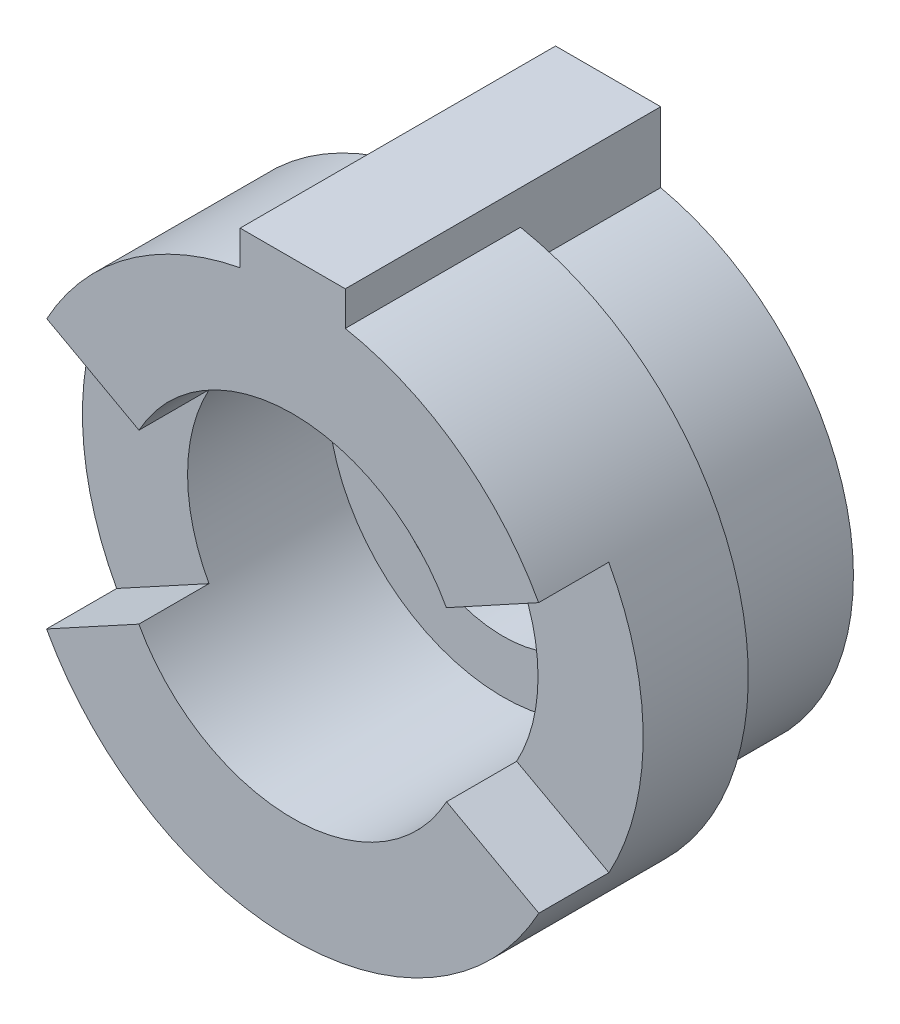
ISO-10303-21;
HEADER;
FILE_DESCRIPTION(('STEP AP214'),'2;1');
FILE_NAME('part.step','',(''),(''),'','','');
FILE_SCHEMA(('AUTOMOTIVE_DESIGN { 1 0 10303 214 1 1 1 1 }'));
ENDSEC;
DATA;
#1=APPLICATION_CONTEXT('core data for automotive mechanical design processes');
#2=APPLICATION_PROTOCOL_DEFINITION('international standard','automotive_design',2000,#1);
#3=PRODUCT_CONTEXT('',#1,'mechanical');
#4=PRODUCT('Part','Part','',(#3));
#5=PRODUCT_RELATED_PRODUCT_CATEGORY('part','',(#4));
#6=PRODUCT_DEFINITION_FORMATION('','',#4);
#7=PRODUCT_DEFINITION_CONTEXT('part definition',#1,'design');
#8=PRODUCT_DEFINITION('design','',#6,#7);
#9=PRODUCT_DEFINITION_SHAPE('','',#8);
#10=(LENGTH_UNIT() NAMED_UNIT(*) SI_UNIT(.MILLI.,.METRE.));
#11=(NAMED_UNIT(*) PLANE_ANGLE_UNIT() SI_UNIT($,.RADIAN.));
#12=(NAMED_UNIT(*) SI_UNIT($,.STERADIAN.) SOLID_ANGLE_UNIT());
#13=UNCERTAINTY_MEASURE_WITH_UNIT(LENGTH_MEASURE(1.E-05),#10,'distance_accuracy_value','');
#14=(GEOMETRIC_REPRESENTATION_CONTEXT(3) GLOBAL_UNCERTAINTY_ASSIGNED_CONTEXT((#13)) GLOBAL_UNIT_ASSIGNED_CONTEXT((#10,
#11,#12)) REPRESENTATION_CONTEXT('',''));
#15=CARTESIAN_POINT('',(0.,0.,0.));
#16=DIRECTION('',(0.,0.,1.));
#17=DIRECTION('',(1.,0.,0.));
#18=AXIS2_PLACEMENT_3D('',#15,#16,#17);
#19=CARTESIAN_POINT('',(0.,0.,9.));
#20=DIRECTION('',(0.,0.,1.));
#21=DIRECTION('',(1.,0.,0.));
#22=AXIS2_PLACEMENT_3D('',#19,#20,#21);
#23=PLANE('',#22);
#24=DIRECTION('',(-0.877200504274681,0.480124229028535,0.));
#25=VECTOR('',#24,1.);
#26=CARTESIAN_POINT('',(-7.01760403419745,3.84099383222828,9.));
#27=LINE('',#26,#25);
#28=CARTESIAN_POINT('',(-4.38600252137341,2.40062114514268,9.));
#29=VERTEX_POINT('',#28);
#30=CARTESIAN_POINT('',(-7.01760403419745,3.84099383222828,9.));
#31=VERTEX_POINT('',#30);
#32=EDGE_CURVE('E239',#29,#31,#27,.T.);
#33=ORIENTED_EDGE('',*,*,#32,.F.);
#34=CARTESIAN_POINT('',(0.,0.,9.));
#35=DIRECTION('',(0.,0.,1.));
#36=DIRECTION('',(1.,0.,0.));
#37=AXIS2_PLACEMENT_3D('',#34,#35,#36);
#38=CIRCLE('',#37,5.);
#39=CARTESIAN_POINT('',(4.38600252137341,2.40062114514267,9.));
#40=VERTEX_POINT('',#39);
#41=EDGE_CURVE('E261',#40,#29,#38,.T.);
#42=ORIENTED_EDGE('',*,*,#41,.F.);
#43=DIRECTION('',(0.877200504274682,0.480124229028534,0.));
#44=VECTOR('',#43,1.);
#45=CARTESIAN_POINT('',(7.01760403419745,3.84099383222827,9.));
#46=LINE('',#45,#44);
#47=CARTESIAN_POINT('',(7.01760403419745,3.84099383222827,9.));
#48=VERTEX_POINT('',#47);
#49=EDGE_CURVE('E93',#40,#48,#46,.T.);
#50=ORIENTED_EDGE('',*,*,#49,.T.);
#51=CARTESIAN_POINT('',(0.,0.,9.));
#52=DIRECTION('',(0.,0.,1.));
#53=DIRECTION('',(1.,0.,0.));
#54=AXIS2_PLACEMENT_3D('',#51,#52,#53);
#55=CIRCLE('',#54,8.);
#56=CARTESIAN_POINT('',(1.50000000000014,7.85811682275083,9.));
#57=VERTEX_POINT('',#56);
#58=EDGE_CURVE('E191',#48,#57,#55,.T.);
#59=ORIENTED_EDGE('',*,*,#58,.T.);
#60=DIRECTION('',(0.,-1.,0.));
#61=VECTOR('',#60,1.);
#62=CARTESIAN_POINT('',(1.50000000000014,7.85811682275083,9.));
#63=LINE('',#62,#61);
#64=CARTESIAN_POINT('',(1.50000000000014,8.83739716558864,9.));
#65=VERTEX_POINT('',#64);
#66=EDGE_CURVE('E172',#65,#57,#63,.T.);
#67=ORIENTED_EDGE('',*,*,#66,.F.);
#68=DIRECTION('',(1.,0.,0.));
#69=VECTOR('',#68,1.);
#70=CARTESIAN_POINT('',(1.50000000000014,8.83739716558864,9.));
#71=LINE('',#70,#69);
#72=CARTESIAN_POINT('',(-1.50000000000014,8.83739716558864,9.));
#73=VERTEX_POINT('',#72);
#74=EDGE_CURVE('E188',#73,#65,#71,.T.);
#75=ORIENTED_EDGE('',*,*,#74,.F.);
#76=DIRECTION('',(0.,1.,0.));
#77=VECTOR('',#76,1.);
#78=CARTESIAN_POINT('',(-1.50000000000014,8.83739716558864,9.));
#79=LINE('',#78,#77);
#80=CARTESIAN_POINT('',(-1.50000000000014,7.85811682275083,9.));
#81=VERTEX_POINT('',#80);
#82=EDGE_CURVE('E181',#81,#73,#79,.T.);
#83=ORIENTED_EDGE('',*,*,#82,.F.);
#84=EDGE_CURVE('E267',#81,#31,#55,.T.);
#85=ORIENTED_EDGE('',*,*,#84,.T.);
#86=EDGE_LOOP('',(#33,#42,#50,#59,#67,#75,#83,#85));
#87=FACE_BOUND('',#86,.T.);
#88=ADVANCED_FACE('F70',(#87),#23,.T.);
#89=CARTESIAN_POINT('',(0.,0.,3.));
#90=DIRECTION('',(0.,0.,1.));
#91=DIRECTION('',(1.,0.,0.));
#92=AXIS2_PLACEMENT_3D('',#89,#90,#91);
#93=PLANE('',#92);
#94=CARTESIAN_POINT('',(0.,0.,3.));
#95=DIRECTION('',(0.,0.,1.));
#96=DIRECTION('',(1.,0.,0.));
#97=AXIS2_PLACEMENT_3D('',#94,#95,#96);
#98=CIRCLE('',#97,5.);
#99=CARTESIAN_POINT('',(5.,0.,3.));
#100=VERTEX_POINT('',#99);
#101=EDGE_CURVE('E271',#100,#100,#98,.F.);
#102=ORIENTED_EDGE('',*,*,#101,.F.);
#103=EDGE_LOOP('',(#102));
#104=FACE_BOUND('',#103,.T.);
#105=CARTESIAN_POINT('',(0.,0.,3.));
#106=DIRECTION('',(0.,0.,1.));
#107=DIRECTION('',(1.,0.,0.));
#108=AXIS2_PLACEMENT_3D('',#105,#106,#107);
#109=CIRCLE('',#108,3.5);
#110=CARTESIAN_POINT('',(3.5,0.,3.));
#111=VERTEX_POINT('',#110);
#112=EDGE_CURVE('E268',#111,#111,#109,.T.);
#113=ORIENTED_EDGE('',*,*,#112,.F.);
#114=EDGE_LOOP('',(#113));
#115=FACE_BOUND('',#114,.T.);
#116=ADVANCED_FACE('F343',(#104,#115),#93,.T.);
#117=CARTESIAN_POINT('',(0.,0.,0.));
#118=DIRECTION('',(0.,0.,1.));
#119=DIRECTION('',(1.,0.,0.));
#120=AXIS2_PLACEMENT_3D('',#117,#118,#119);
#121=PLANE('',#120);
#122=DIRECTION('',(0.,-1.,0.));
#123=VECTOR('',#122,1.);
#124=CARTESIAN_POINT('',(-1.50000000000009,7.85811682275084,0.));
#125=LINE('',#124,#123);
#126=CARTESIAN_POINT('',(-1.50000000000014,8.83739716558864,0.));
#127=VERTEX_POINT('',#126);
#128=CARTESIAN_POINT('',(-1.50000000000009,6.83739716558865,0.));
#129=VERTEX_POINT('',#128);
#130=EDGE_CURVE('E202',#127,#129,#125,.T.);
#131=ORIENTED_EDGE('',*,*,#130,.F.);
#132=DIRECTION('',(1.,0.,0.));
#133=VECTOR('',#132,1.);
#134=CARTESIAN_POINT('',(1.50000000000014,8.83739716558864,0.));
#135=LINE('',#134,#133);
#136=CARTESIAN_POINT('',(1.50000000000014,8.83739716558864,0.));
#137=VERTEX_POINT('',#136);
#138=EDGE_CURVE('E196',#127,#137,#135,.T.);
#139=ORIENTED_EDGE('',*,*,#138,.T.);
#140=DIRECTION('',(0.,1.,0.));
#141=VECTOR('',#140,1.);
#142=CARTESIAN_POINT('',(1.50000000000014,6.83739716558865,0.));
#143=LINE('',#142,#141);
#144=CARTESIAN_POINT('',(1.50000000000014,6.83739716558865,0.));
#145=VERTEX_POINT('',#144);
#146=EDGE_CURVE('E175',#145,#137,#143,.T.);
#147=ORIENTED_EDGE('',*,*,#146,.F.);
#148=CARTESIAN_POINT('',(0.,0.,0.));
#149=DIRECTION('',(0.,0.,1.));
#150=DIRECTION('',(-1.,0.,0.));
#151=AXIS2_PLACEMENT_3D('',#148,#149,#150);
#152=CIRCLE('',#151,7.00000000000001);
#153=EDGE_CURVE('E221',#129,#145,#152,.T.);
#154=ORIENTED_EDGE('',*,*,#153,.F.);
#155=EDGE_LOOP('',(#131,#139,#147,#154));
#156=FACE_BOUND('',#155,.T.);
#157=CARTESIAN_POINT('',(0.,0.,0.));
#158=DIRECTION('',(0.,0.,1.));
#159=DIRECTION('',(1.,0.,0.));
#160=AXIS2_PLACEMENT_3D('',#157,#158,#159);
#161=CIRCLE('',#160,3.5);
#162=CARTESIAN_POINT('',(3.5,0.,0.));
#163=VERTEX_POINT('',#162);
#164=EDGE_CURVE('E266',#163,#163,#161,.T.);
#165=ORIENTED_EDGE('',*,*,#164,.T.);
#166=EDGE_LOOP('',(#165));
#167=FACE_BOUND('',#166,.T.);
#168=ADVANCED_FACE('F329',(#156,#167),#121,.F.);
#169=CARTESIAN_POINT('',(0.,0.,3.));
#170=DIRECTION('',(0.,0.,-1.));
#171=DIRECTION('',(-1.,0.,0.));
#172=AXIS2_PLACEMENT_3D('',#169,#170,#171);
#173=CYLINDRICAL_SURFACE('',#172,8.);
#174=ORIENTED_EDGE('',*,*,#84,.F.);
#175=DIRECTION('',(0.,0.,-1.));
#176=VECTOR('',#175,1.);
#177=CARTESIAN_POINT('',(-1.50000000000014,7.85811682275083,9.));
#178=LINE('',#177,#176);
#179=CARTESIAN_POINT('',(-1.50000000000014,7.85811682275083,4.));
#180=VERTEX_POINT('',#179);
#181=EDGE_CURVE('E203',#81,#180,#178,.T.);
#182=ORIENTED_EDGE('',*,*,#181,.T.);
#183=CARTESIAN_POINT('',(0.,0.,4.));
#184=DIRECTION('',(0.,0.,-1.));
#185=DIRECTION('',(-1.,0.,0.));
#186=AXIS2_PLACEMENT_3D('',#183,#184,#185);
#187=CIRCLE('',#186,8.00000000000001);
#188=CARTESIAN_POINT('',(1.50000000000014,7.85811682275083,4.));
#189=VERTEX_POINT('',#188);
#190=EDGE_CURVE('E206',#189,#180,#187,.T.);
#191=ORIENTED_EDGE('',*,*,#190,.F.);
#192=DIRECTION('',(0.,0.,-1.));
#193=VECTOR('',#192,1.);
#194=CARTESIAN_POINT('',(1.50000000000014,7.85811682275083,9.));
#195=LINE('',#194,#193);
#196=EDGE_CURVE('E180',#57,#189,#195,.T.);
#197=ORIENTED_EDGE('',*,*,#196,.F.);
#198=ORIENTED_EDGE('',*,*,#58,.F.);
#199=DIRECTION('',(0.,0.,1.));
#200=VECTOR('',#199,1.);
#201=CARTESIAN_POINT('',(7.01760403419745,3.84099383222827,7.));
#202=LINE('',#201,#200);
#203=CARTESIAN_POINT('',(7.01760403419745,3.84099383222827,7.));
#204=VERTEX_POINT('',#203);
#205=EDGE_CURVE('E247',#204,#48,#202,.T.);
#206=ORIENTED_EDGE('',*,*,#205,.F.);
#207=CARTESIAN_POINT('',(0.,0.,7.));
#208=DIRECTION('',(0.,0.,-1.));
#209=DIRECTION('',(0.877964062999077,-0.478726544158722,0.));
#210=AXIS2_PLACEMENT_3D('',#207,#208,#209);
#211=CIRCLE('',#210,8.);
#212=CARTESIAN_POINT('',(7.02371250399262,-3.82981235326977,7.));
#213=VERTEX_POINT('',#212);
#214=EDGE_CURVE('E243',#204,#213,#211,.T.);
#215=ORIENTED_EDGE('',*,*,#214,.T.);
#216=DIRECTION('',(0.,0.,-1.));
#217=VECTOR('',#216,1.);
#218=CARTESIAN_POINT('',(7.02371250399262,-3.82981235326977,9.));
#219=LINE('',#218,#217);
#220=CARTESIAN_POINT('',(7.02371250399262,-3.82981235326977,9.));
#221=VERTEX_POINT('',#220);
#222=EDGE_CURVE('E249',#221,#213,#219,.T.);
#223=ORIENTED_EDGE('',*,*,#222,.F.);
#224=CARTESIAN_POINT('',(-7.02371250399263,-3.82981235326976,9.));
#225=VERTEX_POINT('',#224);
#226=EDGE_CURVE('E264',#225,#221,#55,.T.);
#227=ORIENTED_EDGE('',*,*,#226,.F.);
#228=DIRECTION('',(0.,0.,1.));
#229=VECTOR('',#228,1.);
#230=CARTESIAN_POINT('',(-7.02371250399263,-3.82981235326976,7.));
#231=LINE('',#230,#229);
#232=CARTESIAN_POINT('',(-7.02371250399263,-3.82981235326976,7.));
#233=VERTEX_POINT('',#232);
#234=EDGE_CURVE('E231',#233,#225,#231,.T.);
#235=ORIENTED_EDGE('',*,*,#234,.F.);
#236=CARTESIAN_POINT('',(0.,0.,7.));
#237=DIRECTION('',(0.,0.,-1.));
#238=DIRECTION('',(-0.877200504274681,0.480124229028534,0.));
#239=AXIS2_PLACEMENT_3D('',#236,#237,#238);
#240=CIRCLE('',#239,8.);
#241=CARTESIAN_POINT('',(-7.01760403419745,3.84099383222828,7.));
#242=VERTEX_POINT('',#241);
#243=EDGE_CURVE('E227',#233,#242,#240,.T.);
#244=ORIENTED_EDGE('',*,*,#243,.T.);
#245=DIRECTION('',(0.,0.,-1.));
#246=VECTOR('',#245,1.);
#247=CARTESIAN_POINT('',(-7.01760403419745,3.84099383222828,9.));
#248=LINE('',#247,#246);
#249=EDGE_CURVE('E233',#31,#242,#248,.T.);
#250=ORIENTED_EDGE('',*,*,#249,.F.);
#251=EDGE_LOOP('',(#174,#182,#191,#197,#198,#206,#215,#223,#227,#235,#244,#250));
#252=FACE_BOUND('',#251,.T.);
#253=ADVANCED_FACE('F72',(#252),#173,.T.);
#254=CARTESIAN_POINT('',(0.,0.,3.));
#255=DIRECTION('',(0.,0.,-1.));
#256=DIRECTION('',(-1.,0.,0.));
#257=AXIS2_PLACEMENT_3D('',#254,#255,#256);
#258=CYLINDRICAL_SURFACE('',#257,3.5);
#259=ORIENTED_EDGE('',*,*,#112,.T.);
#260=EDGE_LOOP('',(#259));
#261=FACE_BOUND('',#260,.T.);
#262=ORIENTED_EDGE('',*,*,#164,.F.);
#263=EDGE_LOOP('',(#262));
#264=FACE_BOUND('',#263,.T.);
#265=ADVANCED_FACE('F355',(#261,#264),#258,.F.);
#266=DIRECTION('',(-0.877964062999078,-0.47872654415872,0.));
#267=VECTOR('',#266,1.);
#268=CARTESIAN_POINT('',(-7.02371250399263,-3.82981235326976,9.));
#269=LINE('',#268,#267);
#270=CARTESIAN_POINT('',(-4.38982031499539,-2.3936327207936,9.));
#271=VERTEX_POINT('',#270);
#272=EDGE_CURVE('E85',#271,#225,#269,.T.);
#273=ORIENTED_EDGE('',*,*,#272,.T.);
#274=ORIENTED_EDGE('',*,*,#226,.T.);
#275=DIRECTION('',(0.877964062999077,-0.478726544158722,0.));
#276=VECTOR('',#275,1.);
#277=CARTESIAN_POINT('',(7.02371250399262,-3.82981235326977,9.));
#278=LINE('',#277,#276);
#279=CARTESIAN_POINT('',(4.38982031499539,-2.39363272079361,9.));
#280=VERTEX_POINT('',#279);
#281=EDGE_CURVE('E255',#280,#221,#278,.T.);
#282=ORIENTED_EDGE('',*,*,#281,.F.);
#283=EDGE_CURVE('E259',#271,#280,#38,.T.);
#284=ORIENTED_EDGE('',*,*,#283,.F.);
#285=EDGE_LOOP('',(#273,#274,#282,#284));
#286=FACE_BOUND('',#285,.T.);
#287=ADVANCED_FACE('F307',(#286),#23,.T.);
#288=CARTESIAN_POINT('',(0.,0.,9.));
#289=DIRECTION('',(0.,0.,-1.));
#290=DIRECTION('',(-1.,0.,0.));
#291=AXIS2_PLACEMENT_3D('',#288,#289,#290);
#292=CYLINDRICAL_SURFACE('',#291,5.);
#293=DIRECTION('',(0.,0.,-1.));
#294=VECTOR('',#293,1.);
#295=CARTESIAN_POINT('',(-4.38600252137341,2.40062114514268,9.));
#296=LINE('',#295,#294);
#297=CARTESIAN_POINT('',(-4.38600252137341,2.40062114514268,7.));
#298=VERTEX_POINT('',#297);
#299=EDGE_CURVE('E13',#298,#29,#296,.F.);
#300=ORIENTED_EDGE('',*,*,#299,.F.);
#301=CARTESIAN_POINT('',(0.,0.,7.));
#302=DIRECTION('',(0.,0.,1.));
#303=DIRECTION('',(1.,0.,0.));
#304=AXIS2_PLACEMENT_3D('',#301,#302,#303);
#305=CIRCLE('',#304,5.);
#306=CARTESIAN_POINT('',(-4.38982031499539,-2.3936327207936,7.));
#307=VERTEX_POINT('',#306);
#308=EDGE_CURVE('E78',#307,#298,#305,.F.);
#309=ORIENTED_EDGE('',*,*,#308,.F.);
#310=DIRECTION('',(0.,0.,-1.));
#311=VECTOR('',#310,1.);
#312=CARTESIAN_POINT('',(-4.38982031499539,-2.3936327207936,9.));
#313=LINE('',#312,#311);
#314=EDGE_CURVE('E283',#271,#307,#313,.T.);
#315=ORIENTED_EDGE('',*,*,#314,.F.);
#316=ORIENTED_EDGE('',*,*,#283,.T.);
#317=DIRECTION('',(0.,0.,-1.));
#318=VECTOR('',#317,1.);
#319=CARTESIAN_POINT('',(4.38982031499539,-2.39363272079361,9.));
#320=LINE('',#319,#318);
#321=CARTESIAN_POINT('',(4.38982031499539,-2.39363272079361,7.));
#322=VERTEX_POINT('',#321);
#323=EDGE_CURVE('E280',#322,#280,#320,.F.);
#324=ORIENTED_EDGE('',*,*,#323,.F.);
#325=CARTESIAN_POINT('',(0.,0.,7.));
#326=DIRECTION('',(0.,0.,1.));
#327=DIRECTION('',(1.,0.,0.));
#328=AXIS2_PLACEMENT_3D('',#325,#326,#327);
#329=CIRCLE('',#328,5.);
#330=CARTESIAN_POINT('',(4.38600252137341,2.40062114514267,7.));
#331=VERTEX_POINT('',#330);
#332=EDGE_CURVE('E278',#331,#322,#329,.F.);
#333=ORIENTED_EDGE('',*,*,#332,.F.);
#334=DIRECTION('',(0.,0.,-1.));
#335=VECTOR('',#334,1.);
#336=CARTESIAN_POINT('',(4.38600252137341,2.40062114514267,9.));
#337=LINE('',#336,#335);
#338=EDGE_CURVE('E276',#40,#331,#337,.T.);
#339=ORIENTED_EDGE('',*,*,#338,.F.);
#340=ORIENTED_EDGE('',*,*,#41,.T.);
#341=EDGE_LOOP('',(#300,#309,#315,#316,#324,#333,#339,#340));
#342=FACE_BOUND('',#341,.T.);
#343=ORIENTED_EDGE('',*,*,#101,.T.);
#344=EDGE_LOOP('',(#343));
#345=FACE_BOUND('',#344,.T.);
#346=ADVANCED_FACE('F295',(#342,#345),#292,.F.);
#347=CARTESIAN_POINT('',(7.02371250399262,-3.82981235326977,8.));
#348=DIRECTION('',(-0.478726544158722,-0.877964062999077,0.));
#349=DIRECTION('',(0.,0.,-1.));
#350=AXIS2_PLACEMENT_3D('',#347,#348,#349);
#351=PLANE('',#350);
#352=ORIENTED_EDGE('',*,*,#323,.T.);
#353=ORIENTED_EDGE('',*,*,#281,.T.);
#354=ORIENTED_EDGE('',*,*,#222,.T.);
#355=DIRECTION('',(0.877964062999077,-0.478726544158722,0.));
#356=VECTOR('',#355,1.);
#357=CARTESIAN_POINT('',(7.02371250399262,-3.82981235326977,7.));
#358=LINE('',#357,#356);
#359=EDGE_CURVE('E253',#322,#213,#358,.T.);
#360=ORIENTED_EDGE('',*,*,#359,.F.);
#361=EDGE_LOOP('',(#352,#353,#354,#360));
#362=FACE_BOUND('',#361,.T.);
#363=ADVANCED_FACE('F312',(#362),#351,.F.);
#364=CARTESIAN_POINT('',(0.,0.,7.));
#365=DIRECTION('',(0.,0.,1.));
#366=DIRECTION('',(1.,0.,0.));
#367=AXIS2_PLACEMENT_3D('',#364,#365,#366);
#368=PLANE('',#367);
#369=ORIENTED_EDGE('',*,*,#332,.T.);
#370=ORIENTED_EDGE('',*,*,#359,.T.);
#371=ORIENTED_EDGE('',*,*,#214,.F.);
#372=DIRECTION('',(0.877200504274682,0.480124229028534,0.));
#373=VECTOR('',#372,1.);
#374=CARTESIAN_POINT('',(7.01760403419745,3.84099383222827,7.));
#375=LINE('',#374,#373);
#376=EDGE_CURVE('E252',#331,#204,#375,.T.);
#377=ORIENTED_EDGE('',*,*,#376,.F.);
#378=EDGE_LOOP('',(#369,#370,#371,#377));
#379=FACE_BOUND('',#378,.T.);
#380=ADVANCED_FACE('F315',(#379),#368,.T.);
#381=CARTESIAN_POINT('',(7.01760403419745,3.84099383222827,8.));
#382=DIRECTION('',(-0.480124229028534,0.877200504274682,0.));
#383=DIRECTION('',(0.,0.,1.));
#384=AXIS2_PLACEMENT_3D('',#381,#382,#383);
#385=PLANE('',#384);
#386=ORIENTED_EDGE('',*,*,#338,.T.);
#387=ORIENTED_EDGE('',*,*,#376,.T.);
#388=ORIENTED_EDGE('',*,*,#205,.T.);
#389=ORIENTED_EDGE('',*,*,#49,.F.);
#390=EDGE_LOOP('',(#386,#387,#388,#389));
#391=FACE_BOUND('',#390,.T.);
#392=ADVANCED_FACE('F318',(#391),#385,.F.);
#393=CARTESIAN_POINT('',(-7.01760403419745,3.84099383222828,8.));
#394=DIRECTION('',(0.480124229028535,0.877200504274681,0.));
#395=DIRECTION('',(0.,0.,-1.));
#396=AXIS2_PLACEMENT_3D('',#393,#394,#395);
#397=PLANE('',#396);
#398=ORIENTED_EDGE('',*,*,#299,.T.);
#399=ORIENTED_EDGE('',*,*,#32,.T.);
#400=ORIENTED_EDGE('',*,*,#249,.T.);
#401=DIRECTION('',(-0.877200504274681,0.480124229028535,0.));
#402=VECTOR('',#401,1.);
#403=CARTESIAN_POINT('',(-7.01760403419745,3.84099383222828,7.));
#404=LINE('',#403,#402);
#405=EDGE_CURVE('E237',#298,#242,#404,.T.);
#406=ORIENTED_EDGE('',*,*,#405,.F.);
#407=EDGE_LOOP('',(#398,#399,#400,#406));
#408=FACE_BOUND('',#407,.T.);
#409=ADVANCED_FACE('F293',(#408),#397,.F.);
#410=CARTESIAN_POINT('',(0.,0.,7.));
#411=DIRECTION('',(0.,0.,1.));
#412=DIRECTION('',(1.,0.,0.));
#413=AXIS2_PLACEMENT_3D('',#410,#411,#412);
#414=PLANE('',#413);
#415=ORIENTED_EDGE('',*,*,#308,.T.);
#416=ORIENTED_EDGE('',*,*,#405,.T.);
#417=ORIENTED_EDGE('',*,*,#243,.F.);
#418=DIRECTION('',(-0.877964062999078,-0.47872654415872,0.));
#419=VECTOR('',#418,1.);
#420=CARTESIAN_POINT('',(-7.02371250399263,-3.82981235326976,7.));
#421=LINE('',#420,#419);
#422=EDGE_CURVE('E236',#307,#233,#421,.T.);
#423=ORIENTED_EDGE('',*,*,#422,.F.);
#424=EDGE_LOOP('',(#415,#416,#417,#423));
#425=FACE_BOUND('',#424,.T.);
#426=ADVANCED_FACE('F288',(#425),#414,.T.);
#427=CARTESIAN_POINT('',(-7.02371250399263,-3.82981235326976,8.));
#428=DIRECTION('',(0.47872654415872,-0.877964062999078,0.));
#429=DIRECTION('',(0.,0.,1.));
#430=AXIS2_PLACEMENT_3D('',#427,#428,#429);
#431=PLANE('',#430);
#432=ORIENTED_EDGE('',*,*,#314,.T.);
#433=ORIENTED_EDGE('',*,*,#422,.T.);
#434=ORIENTED_EDGE('',*,*,#234,.T.);
#435=ORIENTED_EDGE('',*,*,#272,.F.);
#436=EDGE_LOOP('',(#432,#433,#434,#435));
#437=FACE_BOUND('',#436,.T.);
#438=ADVANCED_FACE('F304',(#437),#431,.F.);
#439=CARTESIAN_POINT('',(1.50000000000014,6.83739716558865,4.));
#440=DIRECTION('',(-1.,0.,0.));
#441=DIRECTION('',(0.,0.,1.));
#442=AXIS2_PLACEMENT_3D('',#439,#440,#441);
#443=PLANE('',#442);
#444=ORIENTED_EDGE('',*,*,#146,.T.);
#445=DIRECTION('',(0.,0.,-1.));
#446=VECTOR('',#445,1.);
#447=CARTESIAN_POINT('',(1.50000000000014,8.83739716558864,9.));
#448=LINE('',#447,#446);
#449=EDGE_CURVE('E169',#65,#137,#448,.T.);
#450=ORIENTED_EDGE('',*,*,#449,.F.);
#451=ORIENTED_EDGE('',*,*,#66,.T.);
#452=ORIENTED_EDGE('',*,*,#196,.T.);
#453=DIRECTION('',(0.,1.,0.));
#454=VECTOR('',#453,1.);
#455=CARTESIAN_POINT('',(1.50000000000014,6.83739716558865,4.));
#456=LINE('',#455,#454);
#457=CARTESIAN_POINT('',(1.50000000000014,6.83739716558865,4.));
#458=VERTEX_POINT('',#457);
#459=EDGE_CURVE('E215',#458,#189,#456,.T.);
#460=ORIENTED_EDGE('',*,*,#459,.F.);
#461=DIRECTION('',(0.,0.,-1.));
#462=VECTOR('',#461,1.);
#463=CARTESIAN_POINT('',(1.50000000000014,6.83739716558865,4.));
#464=LINE('',#463,#462);
#465=EDGE_CURVE('E225',#458,#145,#464,.T.);
#466=ORIENTED_EDGE('',*,*,#465,.T.);
#467=EDGE_LOOP('',(#444,#450,#451,#452,#460,#466));
#468=FACE_BOUND('',#467,.T.);
#469=ADVANCED_FACE('F171',(#468),#443,.F.);
#470=CARTESIAN_POINT('',(0.,0.,4.));
#471=DIRECTION('',(0.,0.,-1.));
#472=DIRECTION('',(-1.,0.,0.));
#473=AXIS2_PLACEMENT_3D('',#470,#471,#472);
#474=CYLINDRICAL_SURFACE('',#473,7.00000000000001);
#475=ORIENTED_EDGE('',*,*,#153,.T.);
#476=ORIENTED_EDGE('',*,*,#465,.F.);
#477=CARTESIAN_POINT('',(0.,0.,4.));
#478=DIRECTION('',(0.,0.,1.));
#479=DIRECTION('',(-1.,0.,0.));
#480=AXIS2_PLACEMENT_3D('',#477,#478,#479);
#481=CIRCLE('',#480,7.00000000000001);
#482=CARTESIAN_POINT('',(-1.50000000000009,6.83739716558865,4.));
#483=VERTEX_POINT('',#482);
#484=EDGE_CURVE('E212',#483,#458,#481,.T.);
#485=ORIENTED_EDGE('',*,*,#484,.F.);
#486=DIRECTION('',(0.,0.,-1.));
#487=VECTOR('',#486,1.);
#488=CARTESIAN_POINT('',(-1.50000000000009,6.83739716558865,4.));
#489=LINE('',#488,#487);
#490=EDGE_CURVE('E218',#483,#129,#489,.T.);
#491=ORIENTED_EDGE('',*,*,#490,.T.);
#492=EDGE_LOOP('',(#475,#476,#485,#491));
#493=FACE_BOUND('',#492,.T.);
#494=ADVANCED_FACE('F326',(#493),#474,.T.);
#495=CARTESIAN_POINT('',(-1.50000000000009,7.85811682275084,4.));
#496=DIRECTION('',(1.,0.,0.));
#497=DIRECTION('',(0.,0.,-1.));
#498=AXIS2_PLACEMENT_3D('',#495,#496,#497);
#499=PLANE('',#498);
#500=ORIENTED_EDGE('',*,*,#130,.T.);
#501=ORIENTED_EDGE('',*,*,#490,.F.);
#502=DIRECTION('',(0.,-1.,0.));
#503=VECTOR('',#502,1.);
#504=CARTESIAN_POINT('',(-1.50000000000009,7.85811682275084,4.));
#505=LINE('',#504,#503);
#506=EDGE_CURVE('E209',#180,#483,#505,.T.);
#507=ORIENTED_EDGE('',*,*,#506,.F.);
#508=ORIENTED_EDGE('',*,*,#181,.F.);
#509=ORIENTED_EDGE('',*,*,#82,.T.);
#510=DIRECTION('',(0.,0.,-1.));
#511=VECTOR('',#510,1.);
#512=CARTESIAN_POINT('',(-1.50000000000014,8.83739716558864,9.));
#513=LINE('',#512,#511);
#514=EDGE_CURVE('E195',#73,#127,#513,.T.);
#515=ORIENTED_EDGE('',*,*,#514,.T.);
#516=EDGE_LOOP('',(#500,#501,#507,#508,#509,#515));
#517=FACE_BOUND('',#516,.T.);
#518=ADVANCED_FACE('F332',(#517),#499,.F.);
#519=CARTESIAN_POINT('',(0.,0.,4.));
#520=DIRECTION('',(0.,0.,-1.));
#521=DIRECTION('',(-1.,0.,0.));
#522=AXIS2_PLACEMENT_3D('',#519,#520,#521);
#523=PLANE('',#522);
#524=ORIENTED_EDGE('',*,*,#190,.T.);
#525=ORIENTED_EDGE('',*,*,#506,.T.);
#526=ORIENTED_EDGE('',*,*,#484,.T.);
#527=ORIENTED_EDGE('',*,*,#459,.T.);
#528=EDGE_LOOP('',(#524,#525,#526,#527));
#529=FACE_BOUND('',#528,.T.);
#530=ADVANCED_FACE('F322',(#529),#523,.T.);
#531=CARTESIAN_POINT('',(1.50000000000014,8.83739716558864,9.));
#532=DIRECTION('',(0.,1.,0.));
#533=DIRECTION('',(0.,0.,1.));
#534=AXIS2_PLACEMENT_3D('',#531,#532,#533);
#535=PLANE('',#534);
#536=ORIENTED_EDGE('',*,*,#138,.F.);
#537=ORIENTED_EDGE('',*,*,#514,.F.);
#538=ORIENTED_EDGE('',*,*,#74,.T.);
#539=ORIENTED_EDGE('',*,*,#449,.T.);
#540=EDGE_LOOP('',(#536,#537,#538,#539));
#541=FACE_BOUND('',#540,.T.);
#542=ADVANCED_FACE('F193',(#541),#535,.T.);
#543=CLOSED_SHELL('',(#88,#116,#168,#253,#265,#287,#346,#363,#380,#392,#409,#426,#438,#469,#494,
#518,#530,#542));
#544=MANIFOLD_SOLID_BREP('B2',#543);
#545=ADVANCED_BREP_SHAPE_REPRESENTATION('',(#18,#544),#14);
#546=SHAPE_DEFINITION_REPRESENTATION(#9,#545);
ENDSEC;
END-ISO-10303-21;
